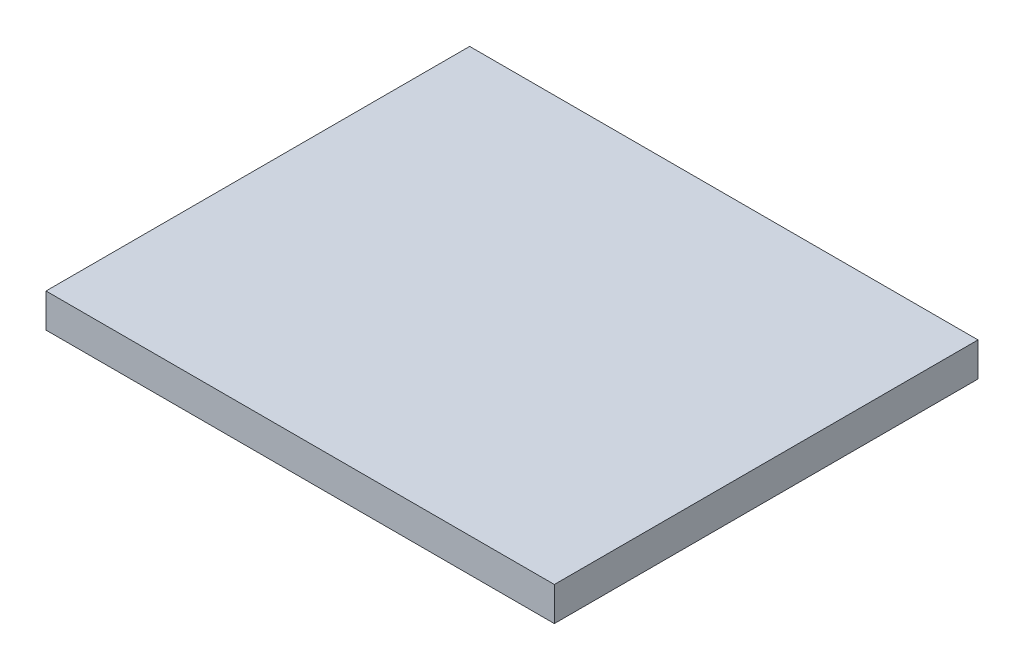
ISO-10303-21;
HEADER;
FILE_DESCRIPTION(('STEP AP214'),'2;1');
FILE_NAME('part.step','',(''),(''),'','','');
FILE_SCHEMA(('AUTOMOTIVE_DESIGN { 1 0 10303 214 1 1 1 1 }'));
ENDSEC;
DATA;
#1=APPLICATION_CONTEXT('core data for automotive mechanical design processes');
#2=APPLICATION_PROTOCOL_DEFINITION('international standard','automotive_design',2000,#1);
#3=PRODUCT_CONTEXT('',#1,'mechanical');
#4=PRODUCT('Part','Part','',(#3));
#5=PRODUCT_RELATED_PRODUCT_CATEGORY('part','',(#4));
#6=PRODUCT_DEFINITION_FORMATION('','',#4);
#7=PRODUCT_DEFINITION_CONTEXT('part definition',#1,'design');
#8=PRODUCT_DEFINITION('design','',#6,#7);
#9=PRODUCT_DEFINITION_SHAPE('','',#8);
#10=(LENGTH_UNIT() NAMED_UNIT(*) SI_UNIT(.MILLI.,.METRE.));
#11=(NAMED_UNIT(*) PLANE_ANGLE_UNIT() SI_UNIT($,.RADIAN.));
#12=(NAMED_UNIT(*) SI_UNIT($,.STERADIAN.) SOLID_ANGLE_UNIT());
#13=UNCERTAINTY_MEASURE_WITH_UNIT(LENGTH_MEASURE(1.E-05),#10,'distance_accuracy_value','');
#14=(GEOMETRIC_REPRESENTATION_CONTEXT(3) GLOBAL_UNCERTAINTY_ASSIGNED_CONTEXT((#13)) GLOBAL_UNIT_ASSIGNED_CONTEXT((#10,
#11,#12)) REPRESENTATION_CONTEXT('',''));
#15=CARTESIAN_POINT('',(0.,0.,0.));
#16=DIRECTION('',(0.,0.,1.));
#17=DIRECTION('',(1.,0.,0.));
#18=AXIS2_PLACEMENT_3D('',#15,#16,#17);
#19=CARTESIAN_POINT('',(30.,0.999999999999973,12.5));
#20=DIRECTION('',(0.,0.,-1.));
#21=DIRECTION('',(-1.,0.,0.));
#22=AXIS2_PLACEMENT_3D('',#19,#20,#21);
#23=PLANE('',#22);
#24=DIRECTION('',(0.,-1.,0.));
#25=VECTOR('',#24,1.);
#26=CARTESIAN_POINT('',(0.,0.999999999999973,12.5));
#27=LINE('',#26,#25);
#28=CARTESIAN_POINT('',(0.,0.999999999999973,12.5));
#29=VERTEX_POINT('',#28);
#30=CARTESIAN_POINT('',(0.,-1.,12.5));
#31=VERTEX_POINT('',#30);
#32=EDGE_CURVE('E93',#29,#31,#27,.T.);
#33=ORIENTED_EDGE('',*,*,#32,.T.);
#34=DIRECTION('',(-1.,0.,0.));
#35=VECTOR('',#34,1.);
#36=CARTESIAN_POINT('',(30.,-1.,12.5));
#37=LINE('',#36,#35);
#38=CARTESIAN_POINT('',(30.,-1.,12.5));
#39=VERTEX_POINT('',#38);
#40=EDGE_CURVE('E11',#39,#31,#37,.T.);
#41=ORIENTED_EDGE('',*,*,#40,.F.);
#42=DIRECTION('',(0.,-1.,0.));
#43=VECTOR('',#42,1.);
#44=CARTESIAN_POINT('',(30.,0.999999999999973,12.5));
#45=LINE('',#44,#43);
#46=CARTESIAN_POINT('',(30.,0.999999999999973,12.5));
#47=VERTEX_POINT('',#46);
#48=EDGE_CURVE('E81',#47,#39,#45,.T.);
#49=ORIENTED_EDGE('',*,*,#48,.F.);
#50=DIRECTION('',(-1.,0.,0.));
#51=VECTOR('',#50,1.);
#52=CARTESIAN_POINT('',(30.,0.999999999999973,12.5));
#53=LINE('',#52,#51);
#54=EDGE_CURVE('E89',#47,#29,#53,.T.);
#55=ORIENTED_EDGE('',*,*,#54,.T.);
#56=EDGE_LOOP('',(#33,#41,#49,#55));
#57=FACE_BOUND('',#56,.T.);
#58=ADVANCED_FACE('F30',(#57),#23,.F.);
#59=CARTESIAN_POINT('',(30.,-1.,-12.5));
#60=DIRECTION('',(0.,1.,0.));
#61=DIRECTION('',(0.,0.,1.));
#62=AXIS2_PLACEMENT_3D('',#59,#60,#61);
#63=PLANE('',#62);
#64=DIRECTION('',(0.,0.,-1.));
#65=VECTOR('',#64,1.);
#66=CARTESIAN_POINT('',(0.,-1.,-12.5));
#67=LINE('',#66,#65);
#68=CARTESIAN_POINT('',(0.,-1.,-12.5));
#69=VERTEX_POINT('',#68);
#70=EDGE_CURVE('E85',#31,#69,#67,.T.);
#71=ORIENTED_EDGE('',*,*,#70,.T.);
#72=DIRECTION('',(-1.,0.,0.));
#73=VECTOR('',#72,1.);
#74=CARTESIAN_POINT('',(30.,-1.,-12.5));
#75=LINE('',#74,#73);
#76=CARTESIAN_POINT('',(30.,-1.,-12.5));
#77=VERTEX_POINT('',#76);
#78=EDGE_CURVE('E38',#77,#69,#75,.T.);
#79=ORIENTED_EDGE('',*,*,#78,.F.);
#80=DIRECTION('',(0.,0.,-1.));
#81=VECTOR('',#80,1.);
#82=CARTESIAN_POINT('',(30.,-1.,-12.5));
#83=LINE('',#82,#81);
#84=EDGE_CURVE('E76',#39,#77,#83,.T.);
#85=ORIENTED_EDGE('',*,*,#84,.F.);
#86=ORIENTED_EDGE('',*,*,#40,.T.);
#87=EDGE_LOOP('',(#71,#79,#85,#86));
#88=FACE_BOUND('',#87,.T.);
#89=ADVANCED_FACE('F84',(#88),#63,.F.);
#90=CARTESIAN_POINT('',(30.,1.,-12.5000000000001));
#91=DIRECTION('',(0.,0.,1.));
#92=DIRECTION('',(1.,0.,0.));
#93=AXIS2_PLACEMENT_3D('',#90,#91,#92);
#94=PLANE('',#93);
#95=DIRECTION('',(0.,1.,0.));
#96=VECTOR('',#95,1.);
#97=CARTESIAN_POINT('',(0.,1.,-12.5000000000001));
#98=LINE('',#97,#96);
#99=CARTESIAN_POINT('',(0.,1.,-12.5000000000001));
#100=VERTEX_POINT('',#99);
#101=EDGE_CURVE('E63',#69,#100,#98,.T.);
#102=ORIENTED_EDGE('',*,*,#101,.T.);
#103=DIRECTION('',(-1.,0.,0.));
#104=VECTOR('',#103,1.);
#105=CARTESIAN_POINT('',(30.,1.,-12.5000000000001));
#106=LINE('',#105,#104);
#107=CARTESIAN_POINT('',(30.,1.,-12.5000000000001));
#108=VERTEX_POINT('',#107);
#109=EDGE_CURVE('E86',#108,#100,#106,.T.);
#110=ORIENTED_EDGE('',*,*,#109,.F.);
#111=DIRECTION('',(0.,1.,0.));
#112=VECTOR('',#111,1.);
#113=CARTESIAN_POINT('',(30.,1.,-12.5000000000001));
#114=LINE('',#113,#112);
#115=EDGE_CURVE('E79',#77,#108,#114,.T.);
#116=ORIENTED_EDGE('',*,*,#115,.F.);
#117=ORIENTED_EDGE('',*,*,#78,.T.);
#118=EDGE_LOOP('',(#102,#110,#116,#117));
#119=FACE_BOUND('',#118,.T.);
#120=ADVANCED_FACE('F87',(#119),#94,.F.);
#121=CARTESIAN_POINT('',(30.,0.999999999999973,12.5));
#122=DIRECTION('',(0.,-1.,0.));
#123=DIRECTION('',(0.,0.,-1.));
#124=AXIS2_PLACEMENT_3D('',#121,#122,#123);
#125=PLANE('',#124);
#126=DIRECTION('',(0.,0.,1.));
#127=VECTOR('',#126,1.);
#128=CARTESIAN_POINT('',(0.,0.999999999999973,12.5));
#129=LINE('',#128,#127);
#130=EDGE_CURVE('E69',#100,#29,#129,.T.);
#131=ORIENTED_EDGE('',*,*,#130,.T.);
#132=ORIENTED_EDGE('',*,*,#54,.F.);
#133=DIRECTION('',(0.,0.,1.));
#134=VECTOR('',#133,1.);
#135=CARTESIAN_POINT('',(30.,0.999999999999973,12.5));
#136=LINE('',#135,#134);
#137=EDGE_CURVE('E46',#108,#47,#136,.T.);
#138=ORIENTED_EDGE('',*,*,#137,.F.);
#139=ORIENTED_EDGE('',*,*,#109,.T.);
#140=EDGE_LOOP('',(#131,#132,#138,#139));
#141=FACE_BOUND('',#140,.T.);
#142=ADVANCED_FACE('F100',(#141),#125,.F.);
#143=CARTESIAN_POINT('',(30.,0.,0.));
#144=DIRECTION('',(-1.,0.,0.));
#145=DIRECTION('',(0.,0.,1.));
#146=AXIS2_PLACEMENT_3D('',#143,#144,#145);
#147=PLANE('',#146);
#148=ORIENTED_EDGE('',*,*,#48,.T.);
#149=ORIENTED_EDGE('',*,*,#84,.T.);
#150=ORIENTED_EDGE('',*,*,#115,.T.);
#151=ORIENTED_EDGE('',*,*,#137,.T.);
#152=EDGE_LOOP('',(#148,#149,#150,#151));
#153=FACE_BOUND('',#152,.T.);
#154=ADVANCED_FACE('F77',(#153),#147,.F.);
#155=CARTESIAN_POINT('',(0.,0.,0.));
#156=DIRECTION('',(-1.,0.,0.));
#157=DIRECTION('',(0.,0.,1.));
#158=AXIS2_PLACEMENT_3D('',#155,#156,#157);
#159=PLANE('',#158);
#160=ORIENTED_EDGE('',*,*,#32,.F.);
#161=ORIENTED_EDGE('',*,*,#130,.F.);
#162=ORIENTED_EDGE('',*,*,#101,.F.);
#163=ORIENTED_EDGE('',*,*,#70,.F.);
#164=EDGE_LOOP('',(#160,#161,#162,#163));
#165=FACE_BOUND('',#164,.T.);
#166=ADVANCED_FACE('F103',(#165),#159,.T.);
#167=CLOSED_SHELL('',(#58,#89,#120,#142,#154,#166));
#168=MANIFOLD_SOLID_BREP('B2',#167);
#169=ADVANCED_BREP_SHAPE_REPRESENTATION('',(#18,#168),#14);
#170=SHAPE_DEFINITION_REPRESENTATION(#9,#169);
ENDSEC;
END-ISO-10303-21;
